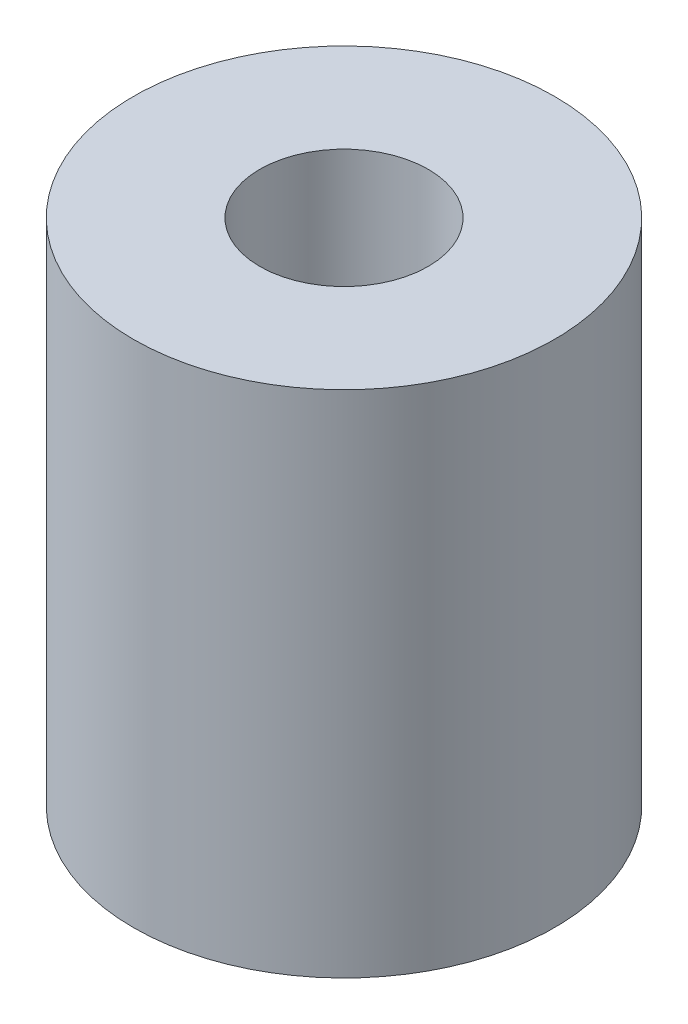
ISO-10303-21;
HEADER;
FILE_DESCRIPTION(('STEP AP214'),'2;1');
FILE_NAME('part.step','',(''),(''),'','','');
FILE_SCHEMA(('AUTOMOTIVE_DESIGN { 1 0 10303 214 1 1 1 1 }'));
ENDSEC;
DATA;
#1=APPLICATION_CONTEXT('core data for automotive mechanical design processes');
#2=APPLICATION_PROTOCOL_DEFINITION('international standard','automotive_design',2000,#1);
#3=PRODUCT_CONTEXT('',#1,'mechanical');
#4=PRODUCT('Part','Part','',(#3));
#5=PRODUCT_RELATED_PRODUCT_CATEGORY('part','',(#4));
#6=PRODUCT_DEFINITION_FORMATION('','',#4);
#7=PRODUCT_DEFINITION_CONTEXT('part definition',#1,'design');
#8=PRODUCT_DEFINITION('design','',#6,#7);
#9=PRODUCT_DEFINITION_SHAPE('','',#8);
#10=(LENGTH_UNIT() NAMED_UNIT(*) SI_UNIT(.MILLI.,.METRE.));
#11=(NAMED_UNIT(*) PLANE_ANGLE_UNIT() SI_UNIT($,.RADIAN.));
#12=(NAMED_UNIT(*) SI_UNIT($,.STERADIAN.) SOLID_ANGLE_UNIT());
#13=UNCERTAINTY_MEASURE_WITH_UNIT(LENGTH_MEASURE(1.E-05),#10,'distance_accuracy_value','');
#14=(GEOMETRIC_REPRESENTATION_CONTEXT(3) GLOBAL_UNCERTAINTY_ASSIGNED_CONTEXT((#13)) GLOBAL_UNIT_ASSIGNED_CONTEXT((#10,
#11,#12)) REPRESENTATION_CONTEXT('',''));
#15=CARTESIAN_POINT('',(0.,0.,0.));
#16=DIRECTION('',(0.,0.,1.));
#17=DIRECTION('',(1.,0.,0.));
#18=AXIS2_PLACEMENT_3D('',#15,#16,#17);
#19=CARTESIAN_POINT('',(0.,6.05,0.));
#20=DIRECTION('',(0.,1.,0.));
#21=DIRECTION('',(0.,0.,1.));
#22=AXIS2_PLACEMENT_3D('',#19,#20,#21);
#23=PLANE('',#22);
#24=CARTESIAN_POINT('',(0.,6.05,0.));
#25=DIRECTION('',(0.,1.,0.));
#26=DIRECTION('',(0.,0.,1.));
#27=AXIS2_PLACEMENT_3D('',#24,#25,#26);
#28=CIRCLE('',#27,5.);
#29=CARTESIAN_POINT('',(0.,6.05,5.));
#30=VERTEX_POINT('',#29);
#31=EDGE_CURVE('E10',#30,#30,#28,.T.);
#32=ORIENTED_EDGE('',*,*,#31,.T.);
#33=EDGE_LOOP('',(#32));
#34=FACE_BOUND('',#33,.T.);
#35=CARTESIAN_POINT('',(0.,6.05,0.));
#36=DIRECTION('',(0.,1.,0.));
#37=DIRECTION('',(0.,0.,1.));
#38=AXIS2_PLACEMENT_3D('',#35,#36,#37);
#39=CIRCLE('',#38,2.);
#40=CARTESIAN_POINT('',(0.,6.05,2.));
#41=VERTEX_POINT('',#40);
#42=EDGE_CURVE('E50',#41,#41,#39,.T.);
#43=ORIENTED_EDGE('',*,*,#42,.F.);
#44=EDGE_LOOP('',(#43));
#45=FACE_BOUND('',#44,.T.);
#46=ADVANCED_FACE('F37',(#34,#45),#23,.T.);
#47=CARTESIAN_POINT('',(0.,-6.05,0.));
#48=DIRECTION('',(0.,1.,0.));
#49=DIRECTION('',(0.,0.,1.));
#50=AXIS2_PLACEMENT_3D('',#47,#48,#49);
#51=PLANE('',#50);
#52=CARTESIAN_POINT('',(0.,-6.05,0.));
#53=DIRECTION('',(0.,1.,0.));
#54=DIRECTION('',(0.,0.,1.));
#55=AXIS2_PLACEMENT_3D('',#52,#53,#54);
#56=CIRCLE('',#55,5.);
#57=CARTESIAN_POINT('',(0.,-6.05,5.));
#58=VERTEX_POINT('',#57);
#59=EDGE_CURVE('E41',#58,#58,#56,.T.);
#60=ORIENTED_EDGE('',*,*,#59,.F.);
#61=EDGE_LOOP('',(#60));
#62=FACE_BOUND('',#61,.T.);
#63=CARTESIAN_POINT('',(0.,-6.05,0.));
#64=DIRECTION('',(0.,1.,0.));
#65=DIRECTION('',(0.,0.,1.));
#66=AXIS2_PLACEMENT_3D('',#63,#64,#65);
#67=CIRCLE('',#66,2.);
#68=CARTESIAN_POINT('',(0.,-6.05,2.));
#69=VERTEX_POINT('',#68);
#70=EDGE_CURVE('E52',#69,#69,#67,.T.);
#71=ORIENTED_EDGE('',*,*,#70,.T.);
#72=EDGE_LOOP('',(#71));
#73=FACE_BOUND('',#72,.T.);
#74=ADVANCED_FACE('F64',(#62,#73),#51,.F.);
#75=CARTESIAN_POINT('',(0.,6.05,0.));
#76=DIRECTION('',(0.,-1.,0.));
#77=DIRECTION('',(0.,0.,-1.));
#78=AXIS2_PLACEMENT_3D('',#75,#76,#77);
#79=CYLINDRICAL_SURFACE('',#78,5.);
#80=ORIENTED_EDGE('',*,*,#31,.F.);
#81=EDGE_LOOP('',(#80));
#82=FACE_BOUND('',#81,.T.);
#83=ORIENTED_EDGE('',*,*,#59,.T.);
#84=EDGE_LOOP('',(#83));
#85=FACE_BOUND('',#84,.T.);
#86=ADVANCED_FACE('F39',(#82,#85),#79,.T.);
#87=CARTESIAN_POINT('',(0.,6.05,0.));
#88=DIRECTION('',(0.,-1.,0.));
#89=DIRECTION('',(0.,0.,-1.));
#90=AXIS2_PLACEMENT_3D('',#87,#88,#89);
#91=CYLINDRICAL_SURFACE('',#90,2.);
#92=ORIENTED_EDGE('',*,*,#42,.T.);
#93=EDGE_LOOP('',(#92));
#94=FACE_BOUND('',#93,.T.);
#95=ORIENTED_EDGE('',*,*,#70,.F.);
#96=EDGE_LOOP('',(#95));
#97=FACE_BOUND('',#96,.T.);
#98=ADVANCED_FACE('F60',(#94,#97),#91,.F.);
#99=CLOSED_SHELL('',(#46,#74,#86,#98));
#100=MANIFOLD_SOLID_BREP('B2',#99);
#101=ADVANCED_BREP_SHAPE_REPRESENTATION('',(#18,#100),#14);
#102=SHAPE_DEFINITION_REPRESENTATION(#9,#101);
ENDSEC;
END-ISO-10303-21;
